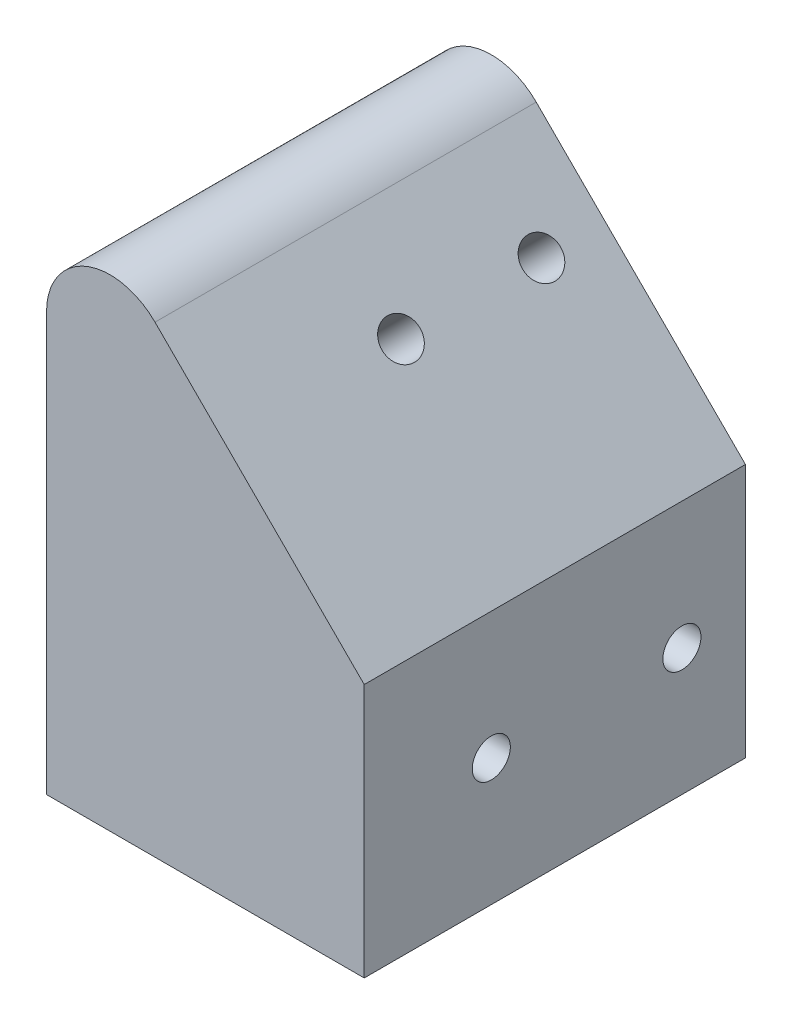
ISO-10303-21;
HEADER;
FILE_DESCRIPTION(('STEP AP214'),'2;1');
FILE_NAME('part.step','',(''),(''),'','','');
FILE_SCHEMA(('AUTOMOTIVE_DESIGN { 1 0 10303 214 1 1 1 1 }'));
ENDSEC;
DATA;
#1=APPLICATION_CONTEXT('core data for automotive mechanical design processes');
#2=APPLICATION_PROTOCOL_DEFINITION('international standard','automotive_design',2000,#1);
#3=PRODUCT_CONTEXT('',#1,'mechanical');
#4=PRODUCT('Part','Part','',(#3));
#5=PRODUCT_RELATED_PRODUCT_CATEGORY('part','',(#4));
#6=PRODUCT_DEFINITION_FORMATION('','',#4);
#7=PRODUCT_DEFINITION_CONTEXT('part definition',#1,'design');
#8=PRODUCT_DEFINITION('design','',#6,#7);
#9=PRODUCT_DEFINITION_SHAPE('','',#8);
#10=(LENGTH_UNIT() NAMED_UNIT(*) SI_UNIT(.MILLI.,.METRE.));
#11=(NAMED_UNIT(*) PLANE_ANGLE_UNIT() SI_UNIT($,.RADIAN.));
#12=(NAMED_UNIT(*) SI_UNIT($,.STERADIAN.) SOLID_ANGLE_UNIT());
#13=UNCERTAINTY_MEASURE_WITH_UNIT(LENGTH_MEASURE(1.E-05),#10,'distance_accuracy_value','');
#14=(GEOMETRIC_REPRESENTATION_CONTEXT(3) GLOBAL_UNCERTAINTY_ASSIGNED_CONTEXT((#13)) GLOBAL_UNIT_ASSIGNED_CONTEXT((#10,
#11,#12)) REPRESENTATION_CONTEXT('',''));
#15=CARTESIAN_POINT('',(0.,0.,0.));
#16=DIRECTION('',(0.,0.,1.));
#17=DIRECTION('',(1.,0.,0.));
#18=AXIS2_PLACEMENT_3D('',#15,#16,#17);
#19=CARTESIAN_POINT('',(25.,-20.,0.));
#20=DIRECTION('',(0.,0.,1.));
#21=DIRECTION('',(1.,0.,0.));
#22=AXIS2_PLACEMENT_3D('',#19,#20,#21);
#23=PLANE('',#22);
#24=DIRECTION('',(0.,1.,0.));
#25=VECTOR('',#24,1.);
#26=CARTESIAN_POINT('',(0.,-20.,0.));
#27=LINE('',#26,#25);
#28=CARTESIAN_POINT('',(0.,-20.,0.));
#29=VERTEX_POINT('',#28);
#30=CARTESIAN_POINT('',(0.,12.9289321881344,0.));
#31=VERTEX_POINT('',#30);
#32=EDGE_CURVE('E100',#29,#31,#27,.T.);
#33=ORIENTED_EDGE('',*,*,#32,.T.);
#34=CARTESIAN_POINT('',(5.,12.9289321881344,0.));
#35=DIRECTION('',(0.,0.,1.));
#36=DIRECTION('',(1.,0.,0.));
#37=AXIS2_PLACEMENT_3D('',#34,#35,#36);
#38=CIRCLE('',#37,5.);
#39=CARTESIAN_POINT('',(8.53553390593272,16.4644660940671,0.));
#40=VERTEX_POINT('',#39);
#41=EDGE_CURVE('E54',#31,#40,#38,.F.);
#42=ORIENTED_EDGE('',*,*,#41,.T.);
#43=DIRECTION('',(0.707106781186551,-0.707106781186544,0.));
#44=VECTOR('',#43,1.);
#45=CARTESIAN_POINT('',(0.,24.9999999999997,0.));
#46=LINE('',#45,#44);
#47=CARTESIAN_POINT('',(25.,0.,0.));
#48=VERTEX_POINT('',#47);
#49=EDGE_CURVE('E75',#40,#48,#46,.T.);
#50=ORIENTED_EDGE('',*,*,#49,.T.);
#51=DIRECTION('',(0.,1.,0.));
#52=VECTOR('',#51,1.);
#53=CARTESIAN_POINT('',(25.,-20.,0.));
#54=LINE('',#53,#52);
#55=CARTESIAN_POINT('',(25.,-20.,0.));
#56=VERTEX_POINT('',#55);
#57=EDGE_CURVE('E78',#56,#48,#54,.T.);
#58=ORIENTED_EDGE('',*,*,#57,.F.);
#59=DIRECTION('',(-1.,0.,0.));
#60=VECTOR('',#59,1.);
#61=CARTESIAN_POINT('',(25.,-20.,0.));
#62=LINE('',#61,#60);
#63=EDGE_CURVE('E99',#56,#29,#62,.T.);
#64=ORIENTED_EDGE('',*,*,#63,.T.);
#65=EDGE_LOOP('',(#33,#42,#50,#58,#64));
#66=FACE_BOUND('',#65,.T.);
#67=ADVANCED_FACE('F32',(#66),#23,.F.);
#68=CARTESIAN_POINT('',(25.,-20.,30.));
#69=DIRECTION('',(0.,0.,-1.));
#70=DIRECTION('',(-1.,0.,0.));
#71=AXIS2_PLACEMENT_3D('',#68,#69,#70);
#72=PLANE('',#71);
#73=DIRECTION('',(0.707106781186551,-0.707106781186544,0.));
#74=VECTOR('',#73,1.);
#75=CARTESIAN_POINT('',(0.,24.9999999999997,30.));
#76=LINE('',#75,#74);
#77=CARTESIAN_POINT('',(8.53553390593272,16.4644660940671,30.));
#78=VERTEX_POINT('',#77);
#79=CARTESIAN_POINT('',(25.,0.,30.));
#80=VERTEX_POINT('',#79);
#81=EDGE_CURVE('E80',#78,#80,#76,.T.);
#82=ORIENTED_EDGE('',*,*,#81,.F.);
#83=CARTESIAN_POINT('',(5.,12.9289321881344,30.));
#84=DIRECTION('',(0.,0.,-1.));
#85=DIRECTION('',(-1.,0.,0.));
#86=AXIS2_PLACEMENT_3D('',#83,#84,#85);
#87=CIRCLE('',#86,5.);
#88=CARTESIAN_POINT('',(0.,12.9289321881344,30.));
#89=VERTEX_POINT('',#88);
#90=EDGE_CURVE('E11',#78,#89,#87,.F.);
#91=ORIENTED_EDGE('',*,*,#90,.T.);
#92=DIRECTION('',(0.,-1.,0.));
#93=VECTOR('',#92,1.);
#94=CARTESIAN_POINT('',(0.,-20.,30.));
#95=LINE('',#94,#93);
#96=CARTESIAN_POINT('',(0.,-20.,30.));
#97=VERTEX_POINT('',#96);
#98=EDGE_CURVE('E102',#89,#97,#95,.T.);
#99=ORIENTED_EDGE('',*,*,#98,.T.);
#100=DIRECTION('',(-1.,0.,0.));
#101=VECTOR('',#100,1.);
#102=CARTESIAN_POINT('',(25.,-20.,30.));
#103=LINE('',#102,#101);
#104=CARTESIAN_POINT('',(25.,-20.,30.));
#105=VERTEX_POINT('',#104);
#106=EDGE_CURVE('E106',#105,#97,#103,.T.);
#107=ORIENTED_EDGE('',*,*,#106,.F.);
#108=DIRECTION('',(0.,-1.,0.));
#109=VECTOR('',#108,1.);
#110=CARTESIAN_POINT('',(25.,-20.,30.));
#111=LINE('',#110,#109);
#112=EDGE_CURVE('E94',#80,#105,#111,.T.);
#113=ORIENTED_EDGE('',*,*,#112,.F.);
#114=EDGE_LOOP('',(#82,#91,#99,#107,#113));
#115=FACE_BOUND('',#114,.T.);
#116=ADVANCED_FACE('F124',(#115),#72,.F.);
#117=CARTESIAN_POINT('',(25.,-20.,0.));
#118=DIRECTION('',(0.,1.,0.));
#119=DIRECTION('',(0.,0.,1.));
#120=AXIS2_PLACEMENT_3D('',#117,#118,#119);
#121=PLANE('',#120);
#122=DIRECTION('',(0.,0.,-1.));
#123=VECTOR('',#122,1.);
#124=CARTESIAN_POINT('',(0.,-20.,0.));
#125=LINE('',#124,#123);
#126=EDGE_CURVE('E91',#97,#29,#125,.T.);
#127=ORIENTED_EDGE('',*,*,#126,.T.);
#128=ORIENTED_EDGE('',*,*,#63,.F.);
#129=DIRECTION('',(0.,0.,-1.));
#130=VECTOR('',#129,1.);
#131=CARTESIAN_POINT('',(25.,-20.,0.));
#132=LINE('',#131,#130);
#133=EDGE_CURVE('E89',#105,#56,#132,.T.);
#134=ORIENTED_EDGE('',*,*,#133,.F.);
#135=ORIENTED_EDGE('',*,*,#106,.T.);
#136=EDGE_LOOP('',(#127,#128,#134,#135));
#137=FACE_BOUND('',#136,.T.);
#138=ADVANCED_FACE('F121',(#137),#121,.F.);
#139=CARTESIAN_POINT('',(25.,0.,0.));
#140=DIRECTION('',(1.,0.,0.));
#141=DIRECTION('',(0.,0.,-1.));
#142=AXIS2_PLACEMENT_3D('',#139,#140,#141);
#143=PLANE('',#142);
#144=CARTESIAN_POINT('',(25.,-9.99999999999998,4.99999999999714));
#145=DIRECTION('',(-1.,0.,0.));
#146=DIRECTION('',(0.,0.,1.));
#147=AXIS2_PLACEMENT_3D('',#144,#145,#146);
#148=CIRCLE('',#147,1.5);
#149=CARTESIAN_POINT('',(25.,-9.99999999999998,6.49999999999714));
#150=VERTEX_POINT('',#149);
#151=EDGE_CURVE('E179',#150,#150,#148,.T.);
#152=ORIENTED_EDGE('',*,*,#151,.T.);
#153=EDGE_LOOP('',(#152));
#154=FACE_BOUND('',#153,.T.);
#155=CARTESIAN_POINT('',(25.,-9.99999999999998,19.9999999999971));
#156=DIRECTION('',(-1.,0.,0.));
#157=DIRECTION('',(0.,0.,1.));
#158=AXIS2_PLACEMENT_3D('',#155,#156,#157);
#159=CIRCLE('',#158,1.5);
#160=CARTESIAN_POINT('',(25.,-9.99999999999998,21.4999999999971));
#161=VERTEX_POINT('',#160);
#162=EDGE_CURVE('E81',#161,#161,#159,.T.);
#163=ORIENTED_EDGE('',*,*,#162,.T.);
#164=EDGE_LOOP('',(#163));
#165=FACE_BOUND('',#164,.T.);
#166=ORIENTED_EDGE('',*,*,#57,.T.);
#167=DIRECTION('',(0.,0.,1.));
#168=VECTOR('',#167,1.);
#169=CARTESIAN_POINT('',(25.,0.,0.));
#170=LINE('',#169,#168);
#171=EDGE_CURVE('E86',#48,#80,#170,.T.);
#172=ORIENTED_EDGE('',*,*,#171,.T.);
#173=ORIENTED_EDGE('',*,*,#112,.T.);
#174=ORIENTED_EDGE('',*,*,#133,.T.);
#175=EDGE_LOOP('',(#166,#172,#173,#174));
#176=FACE_BOUND('',#175,.T.);
#177=ADVANCED_FACE('F85',(#154,#165,#176),#143,.T.);
#178=CARTESIAN_POINT('',(0.,0.,0.));
#179=DIRECTION('',(1.,0.,0.));
#180=DIRECTION('',(0.,0.,-1.));
#181=AXIS2_PLACEMENT_3D('',#178,#179,#180);
#182=PLANE('',#181);
#183=CARTESIAN_POINT('',(0.,-2.89921398068884,5.00066480476496));
#184=DIRECTION('',(1.,0.,0.));
#185=DIRECTION('',(0.,1.,0.));
#186=AXIS2_PLACEMENT_3D('',#183,#184,#185);
#187=ELLIPSE('',#186,2.12132034360238,1.50000000003022);
#188=CARTESIAN_POINT('',(0.,-0.777893637086456,5.00066480476496));
#189=VERTEX_POINT('',#188);
#190=EDGE_CURVE('E168',#189,#189,#187,.T.);
#191=ORIENTED_EDGE('',*,*,#190,.T.);
#192=EDGE_LOOP('',(#191));
#193=FACE_BOUND('',#192,.T.);
#194=CARTESIAN_POINT('',(0.,-2.89921398068883,16.0566278642933));
#195=DIRECTION('',(1.,0.,0.));
#196=DIRECTION('',(0.,1.,0.));
#197=AXIS2_PLACEMENT_3D('',#194,#195,#196);
#198=ELLIPSE('',#197,2.12132034360238,1.50000000003022);
#199=CARTESIAN_POINT('',(0.,-0.777893637086444,16.0566278642933));
#200=VERTEX_POINT('',#199);
#201=EDGE_CURVE('E172',#200,#200,#198,.T.);
#202=ORIENTED_EDGE('',*,*,#201,.T.);
#203=EDGE_LOOP('',(#202));
#204=FACE_BOUND('',#203,.T.);
#205=CARTESIAN_POINT('',(0.,-9.99999999999998,4.99999999999714));
#206=DIRECTION('',(-1.,0.,0.));
#207=DIRECTION('',(0.,0.,1.));
#208=AXIS2_PLACEMENT_3D('',#205,#206,#207);
#209=CIRCLE('',#208,1.5);
#210=CARTESIAN_POINT('',(0.,-9.99999999999998,6.49999999999714));
#211=VERTEX_POINT('',#210);
#212=EDGE_CURVE('E178',#211,#211,#209,.T.);
#213=ORIENTED_EDGE('',*,*,#212,.F.);
#214=EDGE_LOOP('',(#213));
#215=FACE_BOUND('',#214,.T.);
#216=CARTESIAN_POINT('',(0.,-9.99999999999998,19.9999999999971));
#217=DIRECTION('',(-1.,0.,0.));
#218=DIRECTION('',(0.,0.,1.));
#219=AXIS2_PLACEMENT_3D('',#216,#217,#218);
#220=CIRCLE('',#219,1.5);
#221=CARTESIAN_POINT('',(0.,-9.99999999999998,21.4999999999971));
#222=VERTEX_POINT('',#221);
#223=EDGE_CURVE('E182',#222,#222,#220,.T.);
#224=ORIENTED_EDGE('',*,*,#223,.F.);
#225=EDGE_LOOP('',(#224));
#226=FACE_BOUND('',#225,.T.);
#227=ORIENTED_EDGE('',*,*,#98,.F.);
#228=DIRECTION('',(0.,0.,-1.));
#229=VECTOR('',#228,1.);
#230=CARTESIAN_POINT('',(0.,12.9289321881344,0.));
#231=LINE('',#230,#229);
#232=EDGE_CURVE('E109',#89,#31,#231,.T.);
#233=ORIENTED_EDGE('',*,*,#232,.T.);
#234=ORIENTED_EDGE('',*,*,#32,.F.);
#235=ORIENTED_EDGE('',*,*,#126,.F.);
#236=EDGE_LOOP('',(#227,#233,#234,#235));
#237=FACE_BOUND('',#236,.T.);
#238=ADVANCED_FACE('F116',(#193,#204,#215,#226,#237),#182,.F.);
#239=CARTESIAN_POINT('',(0.,24.9999999999997,30.));
#240=DIRECTION('',(0.707106781186544,0.707106781186551,0.));
#241=DIRECTION('',(-0.707106781186551,0.707106781186544,0.));
#242=AXIS2_PLACEMENT_3D('',#239,#240,#241);
#243=PLANE('',#242);
#244=CARTESIAN_POINT('',(13.9496069903443,11.0503930096556,5.00066480476496));
#245=DIRECTION('',(0.707106781186544,0.707106781186551,0.));
#246=DIRECTION('',(-0.707106781186551,0.707106781186544,0.));
#247=AXIS2_PLACEMENT_3D('',#244,#245,#246);
#248=CIRCLE('',#247,1.50000000003022);
#249=CARTESIAN_POINT('',(12.8889468185431,12.1110531814568,5.00066480476496));
#250=VERTEX_POINT('',#249);
#251=EDGE_CURVE('E165',#250,#250,#248,.T.);
#252=ORIENTED_EDGE('',*,*,#251,.F.);
#253=EDGE_LOOP('',(#252));
#254=FACE_BOUND('',#253,.T.);
#255=CARTESIAN_POINT('',(13.9496069903443,11.0503930096556,16.0566278642933));
#256=DIRECTION('',(0.707106781186544,0.707106781186551,0.));
#257=DIRECTION('',(-0.707106781186551,0.707106781186544,0.));
#258=AXIS2_PLACEMENT_3D('',#255,#256,#257);
#259=CIRCLE('',#258,1.50000000003022);
#260=CARTESIAN_POINT('',(12.8889468185431,12.1110531814568,16.0566278642933));
#261=VERTEX_POINT('',#260);
#262=EDGE_CURVE('E169',#261,#261,#259,.T.);
#263=ORIENTED_EDGE('',*,*,#262,.F.);
#264=EDGE_LOOP('',(#263));
#265=FACE_BOUND('',#264,.T.);
#266=ORIENTED_EDGE('',*,*,#49,.F.);
#267=DIRECTION('',(0.,0.,-1.));
#268=VECTOR('',#267,1.);
#269=CARTESIAN_POINT('',(8.53553390593272,16.4644660940671,30.));
#270=LINE('',#269,#268);
#271=EDGE_CURVE('E40',#40,#78,#270,.F.);
#272=ORIENTED_EDGE('',*,*,#271,.T.);
#273=ORIENTED_EDGE('',*,*,#81,.T.);
#274=ORIENTED_EDGE('',*,*,#171,.F.);
#275=EDGE_LOOP('',(#266,#272,#273,#274));
#276=FACE_BOUND('',#275,.T.);
#277=ADVANCED_FACE('F93',(#254,#265,#276),#243,.T.);
#278=CARTESIAN_POINT('',(5.,12.9289321881344,0.));
#279=DIRECTION('',(0.,0.,1.));
#280=DIRECTION('',(1.,0.,0.));
#281=AXIS2_PLACEMENT_3D('',#278,#279,#280);
#282=CYLINDRICAL_SURFACE('',#281,5.);
#283=ORIENTED_EDGE('',*,*,#90,.F.);
#284=ORIENTED_EDGE('',*,*,#271,.F.);
#285=ORIENTED_EDGE('',*,*,#41,.F.);
#286=ORIENTED_EDGE('',*,*,#232,.F.);
#287=EDGE_LOOP('',(#283,#284,#285,#286));
#288=FACE_BOUND('',#287,.T.);
#289=ADVANCED_FACE('F34',(#288),#282,.T.);
#290=CARTESIAN_POINT('',(25.,-9.99999999999998,19.9999999999971));
#291=DIRECTION('',(-1.,0.,0.));
#292=DIRECTION('',(0.,0.,1.));
#293=AXIS2_PLACEMENT_3D('',#290,#291,#292);
#294=CYLINDRICAL_SURFACE('',#293,1.5);
#295=ORIENTED_EDGE('',*,*,#162,.F.);
#296=EDGE_LOOP('',(#295));
#297=FACE_BOUND('',#296,.T.);
#298=ORIENTED_EDGE('',*,*,#223,.T.);
#299=EDGE_LOOP('',(#298));
#300=FACE_BOUND('',#299,.T.);
#301=ADVANCED_FACE('F126',(#297,#300),#294,.F.);
#302=CARTESIAN_POINT('',(25.,-9.99999999999998,4.99999999999714));
#303=DIRECTION('',(-1.,0.,0.));
#304=DIRECTION('',(0.,0.,1.));
#305=AXIS2_PLACEMENT_3D('',#302,#303,#304);
#306=CYLINDRICAL_SURFACE('',#305,1.5);
#307=ORIENTED_EDGE('',*,*,#151,.F.);
#308=EDGE_LOOP('',(#307));
#309=FACE_BOUND('',#308,.T.);
#310=ORIENTED_EDGE('',*,*,#212,.T.);
#311=EDGE_LOOP('',(#310));
#312=FACE_BOUND('',#311,.T.);
#313=ADVANCED_FACE('F131',(#309,#312),#306,.F.);
#314=CARTESIAN_POINT('',(-8.55039300965559,-11.4496069903445,16.0566278642933));
#315=DIRECTION('',(0.707106781186544,0.707106781186551,0.));
#316=DIRECTION('',(-0.707106781186551,0.707106781186544,0.));
#317=AXIS2_PLACEMENT_3D('',#314,#315,#316);
#318=CYLINDRICAL_SURFACE('',#317,1.50000000003022);
#319=ORIENTED_EDGE('',*,*,#262,.T.);
#320=EDGE_LOOP('',(#319));
#321=FACE_BOUND('',#320,.T.);
#322=ORIENTED_EDGE('',*,*,#201,.F.);
#323=EDGE_LOOP('',(#322));
#324=FACE_BOUND('',#323,.T.);
#325=ADVANCED_FACE('F152',(#321,#324),#318,.F.);
#326=CARTESIAN_POINT('',(-8.55039300965558,-11.4496069903445,5.00066480476496));
#327=DIRECTION('',(0.707106781186544,0.707106781186551,0.));
#328=DIRECTION('',(-0.707106781186551,0.707106781186544,0.));
#329=AXIS2_PLACEMENT_3D('',#326,#327,#328);
#330=CYLINDRICAL_SURFACE('',#329,1.50000000003022);
#331=ORIENTED_EDGE('',*,*,#251,.T.);
#332=EDGE_LOOP('',(#331));
#333=FACE_BOUND('',#332,.T.);
#334=ORIENTED_EDGE('',*,*,#190,.F.);
#335=EDGE_LOOP('',(#334));
#336=FACE_BOUND('',#335,.T.);
#337=ADVANCED_FACE('F156',(#333,#336),#330,.F.);
#338=CLOSED_SHELL('',(#67,#116,#138,#177,#238,#277,#289,#301,#313,#325,#337));
#339=MANIFOLD_SOLID_BREP('B2',#338);
#340=ADVANCED_BREP_SHAPE_REPRESENTATION('',(#18,#339),#14);
#341=SHAPE_DEFINITION_REPRESENTATION(#9,#340);
ENDSEC;
END-ISO-10303-21;
